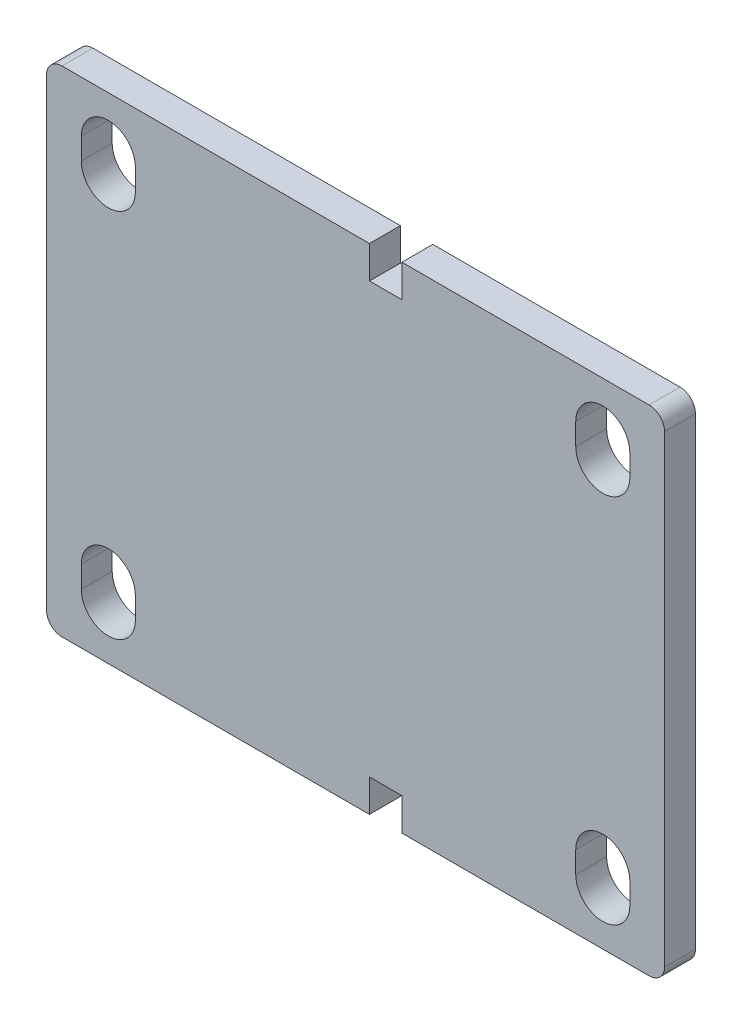
ISO-10303-21;
HEADER;
FILE_DESCRIPTION(('STEP AP214'),'2;1');
FILE_NAME('part.step','',(''),(''),'','','');
FILE_SCHEMA(('AUTOMOTIVE_DESIGN { 1 0 10303 214 1 1 1 1 }'));
ENDSEC;
DATA;
#1=APPLICATION_CONTEXT('core data for automotive mechanical design processes');
#2=APPLICATION_PROTOCOL_DEFINITION('international standard','automotive_design',2000,#1);
#3=PRODUCT_CONTEXT('',#1,'mechanical');
#4=PRODUCT('Part','Part','',(#3));
#5=PRODUCT_RELATED_PRODUCT_CATEGORY('part','',(#4));
#6=PRODUCT_DEFINITION_FORMATION('','',#4);
#7=PRODUCT_DEFINITION_CONTEXT('part definition',#1,'design');
#8=PRODUCT_DEFINITION('design','',#6,#7);
#9=PRODUCT_DEFINITION_SHAPE('','',#8);
#10=(LENGTH_UNIT() NAMED_UNIT(*) SI_UNIT(.MILLI.,.METRE.));
#11=(NAMED_UNIT(*) PLANE_ANGLE_UNIT() SI_UNIT($,.RADIAN.));
#12=(NAMED_UNIT(*) SI_UNIT($,.STERADIAN.) SOLID_ANGLE_UNIT());
#13=UNCERTAINTY_MEASURE_WITH_UNIT(LENGTH_MEASURE(1.E-05),#10,'distance_accuracy_value','');
#14=(GEOMETRIC_REPRESENTATION_CONTEXT(3) GLOBAL_UNCERTAINTY_ASSIGNED_CONTEXT((#13)) GLOBAL_UNIT_ASSIGNED_CONTEXT((#10,
#11,#12)) REPRESENTATION_CONTEXT('',''));
#15=CARTESIAN_POINT('',(0.,0.,0.));
#16=DIRECTION('',(0.,0.,1.));
#17=DIRECTION('',(1.,0.,0.));
#18=AXIS2_PLACEMENT_3D('',#15,#16,#17);
#19=CARTESIAN_POINT('',(0.,0.,10.));
#20=DIRECTION('',(0.,0.,1.));
#21=DIRECTION('',(1.,0.,0.));
#22=AXIS2_PLACEMENT_3D('',#19,#20,#21);
#23=PLANE('',#22);
#24=CARTESIAN_POINT('',(80.,-63.5,10.));
#25=DIRECTION('',(0.,0.,1.));
#26=DIRECTION('',(-1.,0.,0.));
#27=AXIS2_PLACEMENT_3D('',#24,#25,#26);
#28=CIRCLE('',#27,8.75000000000001);
#29=CARTESIAN_POINT('',(71.25,-63.5,10.));
#30=VERTEX_POINT('',#29);
#31=CARTESIAN_POINT('',(88.75,-63.5,10.));
#32=VERTEX_POINT('',#31);
#33=EDGE_CURVE('E299',#30,#32,#28,.T.);
#34=ORIENTED_EDGE('',*,*,#33,.F.);
#35=DIRECTION('',(0.,-1.,0.));
#36=VECTOR('',#35,1.);
#37=CARTESIAN_POINT('',(71.25,-63.5,10.));
#38=LINE('',#37,#36);
#39=CARTESIAN_POINT('',(71.25,-56.5,10.));
#40=VERTEX_POINT('',#39);
#41=EDGE_CURVE('E307',#40,#30,#38,.T.);
#42=ORIENTED_EDGE('',*,*,#41,.F.);
#43=CARTESIAN_POINT('',(80.,-56.5,10.));
#44=DIRECTION('',(0.,0.,1.));
#45=DIRECTION('',(-1.,0.,0.));
#46=AXIS2_PLACEMENT_3D('',#43,#44,#45);
#47=CIRCLE('',#46,8.75000000000001);
#48=CARTESIAN_POINT('',(88.75,-56.5,10.));
#49=VERTEX_POINT('',#48);
#50=EDGE_CURVE('E319',#49,#40,#47,.T.);
#51=ORIENTED_EDGE('',*,*,#50,.F.);
#52=DIRECTION('',(0.,1.,0.));
#53=VECTOR('',#52,1.);
#54=CARTESIAN_POINT('',(88.75,-63.5,10.));
#55=LINE('',#54,#53);
#56=EDGE_CURVE('E317',#32,#49,#55,.T.);
#57=ORIENTED_EDGE('',*,*,#56,.F.);
#58=EDGE_LOOP('',(#34,#42,#51,#57));
#59=FACE_BOUND('',#58,.T.);
#60=DIRECTION('',(0.,1.,0.));
#61=VECTOR('',#60,1.);
#62=CARTESIAN_POINT('',(-71.25,63.5,10.));
#63=LINE('',#62,#61);
#64=CARTESIAN_POINT('',(-71.25,56.5,10.));
#65=VERTEX_POINT('',#64);
#66=CARTESIAN_POINT('',(-71.25,63.5,10.));
#67=VERTEX_POINT('',#66);
#68=EDGE_CURVE('E369',#65,#67,#63,.T.);
#69=ORIENTED_EDGE('',*,*,#68,.F.);
#70=CARTESIAN_POINT('',(-80.,56.5,10.));
#71=DIRECTION('',(0.,0.,1.));
#72=DIRECTION('',(1.,0.,0.));
#73=AXIS2_PLACEMENT_3D('',#70,#71,#72);
#74=CIRCLE('',#73,8.75000000000001);
#75=CARTESIAN_POINT('',(-88.75,56.5,10.));
#76=VERTEX_POINT('',#75);
#77=EDGE_CURVE('E383',#76,#65,#74,.T.);
#78=ORIENTED_EDGE('',*,*,#77,.F.);
#79=DIRECTION('',(0.,-1.,0.));
#80=VECTOR('',#79,1.);
#81=CARTESIAN_POINT('',(-88.75,63.5,10.));
#82=LINE('',#81,#80);
#83=CARTESIAN_POINT('',(-88.75,63.5,10.));
#84=VERTEX_POINT('',#83);
#85=EDGE_CURVE('E381',#84,#76,#82,.T.);
#86=ORIENTED_EDGE('',*,*,#85,.F.);
#87=CARTESIAN_POINT('',(-80.,63.5,10.));
#88=DIRECTION('',(0.,0.,1.));
#89=DIRECTION('',(1.,0.,0.));
#90=AXIS2_PLACEMENT_3D('',#87,#88,#89);
#91=CIRCLE('',#90,8.75000000000001);
#92=EDGE_CURVE('E357',#67,#84,#91,.T.);
#93=ORIENTED_EDGE('',*,*,#92,.F.);
#94=EDGE_LOOP('',(#69,#78,#86,#93));
#95=FACE_BOUND('',#94,.T.);
#96=DIRECTION('',(0.,-1.,0.));
#97=VECTOR('',#96,1.);
#98=CARTESIAN_POINT('',(-100.,-80.,10.));
#99=LINE('',#98,#97);
#100=CARTESIAN_POINT('',(-100.,75.,10.));
#101=VERTEX_POINT('',#100);
#102=CARTESIAN_POINT('',(-100.,-75.,10.));
#103=VERTEX_POINT('',#102);
#104=EDGE_CURVE('E452',#101,#103,#99,.T.);
#105=ORIENTED_EDGE('',*,*,#104,.T.);
#106=CARTESIAN_POINT('',(-95.,-75.,10.));
#107=DIRECTION('',(0.,0.,1.));
#108=DIRECTION('',(1.,0.,0.));
#109=AXIS2_PLACEMENT_3D('',#106,#107,#108);
#110=CIRCLE('',#109,5.);
#111=CARTESIAN_POINT('',(-95.,-80.,10.));
#112=VERTEX_POINT('',#111);
#113=EDGE_CURVE('E497',#103,#112,#110,.T.);
#114=ORIENTED_EDGE('',*,*,#113,.T.);
#115=DIRECTION('',(1.,0.,0.));
#116=VECTOR('',#115,1.);
#117=CARTESIAN_POINT('',(100.,-80.,10.));
#118=LINE('',#117,#116);
#119=CARTESIAN_POINT('',(4.50000000000002,-80.,10.));
#120=VERTEX_POINT('',#119);
#121=EDGE_CURVE('E457',#112,#120,#118,.T.);
#122=ORIENTED_EDGE('',*,*,#121,.T.);
#123=DIRECTION('',(0.,-1.,0.));
#124=VECTOR('',#123,1.);
#125=CARTESIAN_POINT('',(4.50000000000001,-80.,10.));
#126=LINE('',#125,#124);
#127=CARTESIAN_POINT('',(4.50000000000001,-69.5,10.));
#128=VERTEX_POINT('',#127);
#129=EDGE_CURVE('E402',#128,#120,#126,.T.);
#130=ORIENTED_EDGE('',*,*,#129,.F.);
#131=DIRECTION('',(-1.,0.,0.));
#132=VECTOR('',#131,1.);
#133=CARTESIAN_POINT('',(15.,-69.5,10.));
#134=LINE('',#133,#132);
#135=CARTESIAN_POINT('',(15.,-69.5,10.));
#136=VERTEX_POINT('',#135);
#137=EDGE_CURVE('E411',#136,#128,#134,.T.);
#138=ORIENTED_EDGE('',*,*,#137,.F.);
#139=DIRECTION('',(0.,1.,0.));
#140=VECTOR('',#139,1.);
#141=CARTESIAN_POINT('',(15.,-80.,10.));
#142=LINE('',#141,#140);
#143=CARTESIAN_POINT('',(15.,-80.,10.));
#144=VERTEX_POINT('',#143);
#145=EDGE_CURVE('E390',#144,#136,#142,.T.);
#146=ORIENTED_EDGE('',*,*,#145,.F.);
#147=CARTESIAN_POINT('',(95.,-80.,10.));
#148=VERTEX_POINT('',#147);
#149=EDGE_CURVE('E455',#144,#148,#118,.T.);
#150=ORIENTED_EDGE('',*,*,#149,.T.);
#151=CARTESIAN_POINT('',(95.,-75.,10.));
#152=DIRECTION('',(0.,0.,1.));
#153=DIRECTION('',(1.,0.,0.));
#154=AXIS2_PLACEMENT_3D('',#151,#152,#153);
#155=CIRCLE('',#154,5.);
#156=CARTESIAN_POINT('',(100.,-75.,10.));
#157=VERTEX_POINT('',#156);
#158=EDGE_CURVE('E495',#148,#157,#155,.T.);
#159=ORIENTED_EDGE('',*,*,#158,.T.);
#160=DIRECTION('',(0.,1.,0.));
#161=VECTOR('',#160,1.);
#162=CARTESIAN_POINT('',(100.,-80.,10.));
#163=LINE('',#162,#161);
#164=CARTESIAN_POINT('',(100.,75.,10.));
#165=VERTEX_POINT('',#164);
#166=EDGE_CURVE('E459',#157,#165,#163,.T.);
#167=ORIENTED_EDGE('',*,*,#166,.T.);
#168=CARTESIAN_POINT('',(95.,75.,10.));
#169=DIRECTION('',(0.,0.,1.));
#170=DIRECTION('',(1.,0.,0.));
#171=AXIS2_PLACEMENT_3D('',#168,#169,#170);
#172=CIRCLE('',#171,5.);
#173=CARTESIAN_POINT('',(95.,80.,10.));
#174=VERTEX_POINT('',#173);
#175=EDGE_CURVE('E493',#165,#174,#172,.T.);
#176=ORIENTED_EDGE('',*,*,#175,.T.);
#177=DIRECTION('',(-1.,0.,0.));
#178=VECTOR('',#177,1.);
#179=CARTESIAN_POINT('',(100.,80.,10.));
#180=LINE('',#179,#178);
#181=CARTESIAN_POINT('',(15.,80.,10.));
#182=VERTEX_POINT('',#181);
#183=EDGE_CURVE('E463',#174,#182,#180,.T.);
#184=ORIENTED_EDGE('',*,*,#183,.T.);
#185=DIRECTION('',(0.,1.,0.));
#186=VECTOR('',#185,1.);
#187=CARTESIAN_POINT('',(15.,80.,10.));
#188=LINE('',#187,#186);
#189=CARTESIAN_POINT('',(15.,69.5,10.));
#190=VERTEX_POINT('',#189);
#191=EDGE_CURVE('E418',#190,#182,#188,.T.);
#192=ORIENTED_EDGE('',*,*,#191,.F.);
#193=DIRECTION('',(1.,0.,0.));
#194=VECTOR('',#193,1.);
#195=CARTESIAN_POINT('',(15.,69.5,10.));
#196=LINE('',#195,#194);
#197=CARTESIAN_POINT('',(4.50000000000001,69.5,10.));
#198=VERTEX_POINT('',#197);
#199=EDGE_CURVE('E429',#198,#190,#196,.T.);
#200=ORIENTED_EDGE('',*,*,#199,.F.);
#201=DIRECTION('',(0.,-1.,0.));
#202=VECTOR('',#201,1.);
#203=CARTESIAN_POINT('',(4.50000000000001,80.,10.));
#204=LINE('',#203,#202);
#205=CARTESIAN_POINT('',(4.50000000000001,80.,10.));
#206=VERTEX_POINT('',#205);
#207=EDGE_CURVE('E438',#206,#198,#204,.T.);
#208=ORIENTED_EDGE('',*,*,#207,.F.);
#209=CARTESIAN_POINT('',(-95.,80.,10.));
#210=VERTEX_POINT('',#209);
#211=EDGE_CURVE('E462',#206,#210,#180,.T.);
#212=ORIENTED_EDGE('',*,*,#211,.T.);
#213=CARTESIAN_POINT('',(-95.,75.,10.));
#214=DIRECTION('',(0.,0.,1.));
#215=DIRECTION('',(1.,0.,0.));
#216=AXIS2_PLACEMENT_3D('',#213,#214,#215);
#217=CIRCLE('',#216,5.);
#218=EDGE_CURVE('E491',#210,#101,#217,.T.);
#219=ORIENTED_EDGE('',*,*,#218,.T.);
#220=EDGE_LOOP('',(#105,#114,#122,#130,#138,#146,#150,#159,#167,#176,#184,#192,#200,#208,#212,#219));
#221=FACE_BOUND('',#220,.T.);
#222=DIRECTION('',(0.,-1.,0.));
#223=VECTOR('',#222,1.);
#224=CARTESIAN_POINT('',(-71.25,-63.5,10.));
#225=LINE('',#224,#223);
#226=CARTESIAN_POINT('',(-71.25,-56.5,10.));
#227=VERTEX_POINT('',#226);
#228=CARTESIAN_POINT('',(-71.25,-63.5,10.));
#229=VERTEX_POINT('',#228);
#230=EDGE_CURVE('E346',#227,#229,#225,.T.);
#231=ORIENTED_EDGE('',*,*,#230,.T.);
#232=CARTESIAN_POINT('',(-80.,-63.5,10.));
#233=DIRECTION('',(0.,0.,-1.));
#234=DIRECTION('',(1.,0.,0.));
#235=AXIS2_PLACEMENT_3D('',#232,#233,#234);
#236=CIRCLE('',#235,8.75000000000001);
#237=CARTESIAN_POINT('',(-88.75,-63.5,10.));
#238=VERTEX_POINT('',#237);
#239=EDGE_CURVE('E326',#229,#238,#236,.T.);
#240=ORIENTED_EDGE('',*,*,#239,.T.);
#241=DIRECTION('',(0.,1.,0.));
#242=VECTOR('',#241,1.);
#243=CARTESIAN_POINT('',(-88.75,-63.5,10.));
#244=LINE('',#243,#242);
#245=CARTESIAN_POINT('',(-88.75,-56.5,10.));
#246=VERTEX_POINT('',#245);
#247=EDGE_CURVE('E337',#238,#246,#244,.T.);
#248=ORIENTED_EDGE('',*,*,#247,.T.);
#249=CARTESIAN_POINT('',(-80.,-56.5,10.));
#250=DIRECTION('',(0.,0.,-1.));
#251=DIRECTION('',(1.,0.,0.));
#252=AXIS2_PLACEMENT_3D('',#249,#250,#251);
#253=CIRCLE('',#252,8.75000000000001);
#254=EDGE_CURVE('E349',#246,#227,#253,.T.);
#255=ORIENTED_EDGE('',*,*,#254,.T.);
#256=EDGE_LOOP('',(#231,#240,#248,#255));
#257=FACE_BOUND('',#256,.T.);
#258=DIRECTION('',(0.,1.,0.));
#259=VECTOR('',#258,1.);
#260=CARTESIAN_POINT('',(71.25,63.5,10.));
#261=LINE('',#260,#259);
#262=CARTESIAN_POINT('',(71.25,56.5,10.));
#263=VERTEX_POINT('',#262);
#264=CARTESIAN_POINT('',(71.25,63.5,10.));
#265=VERTEX_POINT('',#264);
#266=EDGE_CURVE('E293',#263,#265,#261,.T.);
#267=ORIENTED_EDGE('',*,*,#266,.T.);
#268=CARTESIAN_POINT('',(80.,63.5,10.));
#269=DIRECTION('',(0.,0.,-1.));
#270=DIRECTION('',(-1.,0.,0.));
#271=AXIS2_PLACEMENT_3D('',#268,#269,#270);
#272=CIRCLE('',#271,8.75000000000001);
#273=CARTESIAN_POINT('',(88.75,63.5,10.));
#274=VERTEX_POINT('',#273);
#275=EDGE_CURVE('E69',#265,#274,#272,.T.);
#276=ORIENTED_EDGE('',*,*,#275,.T.);
#277=DIRECTION('',(0.,-1.,0.));
#278=VECTOR('',#277,1.);
#279=CARTESIAN_POINT('',(88.75,63.5,10.));
#280=LINE('',#279,#278);
#281=CARTESIAN_POINT('',(88.75,56.5,10.));
#282=VERTEX_POINT('',#281);
#283=EDGE_CURVE('E284',#274,#282,#280,.T.);
#284=ORIENTED_EDGE('',*,*,#283,.T.);
#285=CARTESIAN_POINT('',(80.,56.5,10.));
#286=DIRECTION('',(0.,0.,-1.));
#287=DIRECTION('',(-1.,0.,0.));
#288=AXIS2_PLACEMENT_3D('',#285,#286,#287);
#289=CIRCLE('',#288,8.75000000000001);
#290=EDGE_CURVE('E287',#282,#263,#289,.T.);
#291=ORIENTED_EDGE('',*,*,#290,.T.);
#292=EDGE_LOOP('',(#267,#276,#284,#291));
#293=FACE_BOUND('',#292,.T.);
#294=ADVANCED_FACE('F54',(#59,#95,#221,#257,#293),#23,.T.);
#295=CARTESIAN_POINT('',(0.,0.,0.));
#296=DIRECTION('',(0.,0.,1.));
#297=DIRECTION('',(1.,0.,0.));
#298=AXIS2_PLACEMENT_3D('',#295,#296,#297);
#299=PLANE('',#298);
#300=DIRECTION('',(1.,0.,0.));
#301=VECTOR('',#300,1.);
#302=CARTESIAN_POINT('',(100.,-80.,0.));
#303=LINE('',#302,#301);
#304=CARTESIAN_POINT('',(-95.,-80.,0.));
#305=VERTEX_POINT('',#304);
#306=CARTESIAN_POINT('',(4.50000000000001,-80.,0.));
#307=VERTEX_POINT('',#306);
#308=EDGE_CURVE('E469',#305,#307,#303,.T.);
#309=ORIENTED_EDGE('',*,*,#308,.F.);
#310=CARTESIAN_POINT('',(-95.,-75.,0.));
#311=DIRECTION('',(0.,0.,1.));
#312=DIRECTION('',(1.,0.,0.));
#313=AXIS2_PLACEMENT_3D('',#310,#311,#312);
#314=CIRCLE('',#313,5.);
#315=CARTESIAN_POINT('',(-100.,-75.,0.));
#316=VERTEX_POINT('',#315);
#317=EDGE_CURVE('E484',#305,#316,#314,.F.);
#318=ORIENTED_EDGE('',*,*,#317,.T.);
#319=DIRECTION('',(0.,-1.,0.));
#320=VECTOR('',#319,1.);
#321=CARTESIAN_POINT('',(-100.,-80.,0.));
#322=LINE('',#321,#320);
#323=CARTESIAN_POINT('',(-100.,75.,0.));
#324=VERTEX_POINT('',#323);
#325=EDGE_CURVE('E445',#324,#316,#322,.T.);
#326=ORIENTED_EDGE('',*,*,#325,.F.);
#327=CARTESIAN_POINT('',(-95.,75.,0.));
#328=DIRECTION('',(0.,0.,1.));
#329=DIRECTION('',(1.,0.,0.));
#330=AXIS2_PLACEMENT_3D('',#327,#328,#329);
#331=CIRCLE('',#330,5.);
#332=CARTESIAN_POINT('',(-95.,80.,0.));
#333=VERTEX_POINT('',#332);
#334=EDGE_CURVE('E478',#324,#333,#331,.F.);
#335=ORIENTED_EDGE('',*,*,#334,.T.);
#336=DIRECTION('',(-1.,0.,0.));
#337=VECTOR('',#336,1.);
#338=CARTESIAN_POINT('',(100.,80.,0.));
#339=LINE('',#338,#337);
#340=CARTESIAN_POINT('',(4.50000000000002,80.,0.));
#341=VERTEX_POINT('',#340);
#342=EDGE_CURVE('E474',#341,#333,#339,.T.);
#343=ORIENTED_EDGE('',*,*,#342,.F.);
#344=DIRECTION('',(0.,-1.,0.));
#345=VECTOR('',#344,1.);
#346=CARTESIAN_POINT('',(4.50000000000001,80.,0.));
#347=LINE('',#346,#345);
#348=CARTESIAN_POINT('',(4.50000000000001,69.5,0.));
#349=VERTEX_POINT('',#348);
#350=EDGE_CURVE('E428',#341,#349,#347,.T.);
#351=ORIENTED_EDGE('',*,*,#350,.T.);
#352=DIRECTION('',(1.,0.,0.));
#353=VECTOR('',#352,1.);
#354=CARTESIAN_POINT('',(15.,69.5,0.));
#355=LINE('',#354,#353);
#356=CARTESIAN_POINT('',(15.,69.5,0.));
#357=VERTEX_POINT('',#356);
#358=EDGE_CURVE('E432',#349,#357,#355,.T.);
#359=ORIENTED_EDGE('',*,*,#358,.T.);
#360=DIRECTION('',(0.,1.,0.));
#361=VECTOR('',#360,1.);
#362=CARTESIAN_POINT('',(15.,80.,0.));
#363=LINE('',#362,#361);
#364=CARTESIAN_POINT('',(15.,80.,0.));
#365=VERTEX_POINT('',#364);
#366=EDGE_CURVE('E425',#357,#365,#363,.T.);
#367=ORIENTED_EDGE('',*,*,#366,.T.);
#368=CARTESIAN_POINT('',(95.,80.,0.));
#369=VERTEX_POINT('',#368);
#370=EDGE_CURVE('E456',#369,#365,#339,.T.);
#371=ORIENTED_EDGE('',*,*,#370,.F.);
#372=CARTESIAN_POINT('',(95.,75.,0.));
#373=DIRECTION('',(0.,0.,1.));
#374=DIRECTION('',(1.,0.,0.));
#375=AXIS2_PLACEMENT_3D('',#372,#373,#374);
#376=CIRCLE('',#375,5.);
#377=CARTESIAN_POINT('',(100.,75.,0.));
#378=VERTEX_POINT('',#377);
#379=EDGE_CURVE('E480',#369,#378,#376,.F.);
#380=ORIENTED_EDGE('',*,*,#379,.T.);
#381=DIRECTION('',(0.,1.,0.));
#382=VECTOR('',#381,1.);
#383=CARTESIAN_POINT('',(100.,-80.,0.));
#384=LINE('',#383,#382);
#385=CARTESIAN_POINT('',(100.,-75.,0.));
#386=VERTEX_POINT('',#385);
#387=EDGE_CURVE('E471',#386,#378,#384,.T.);
#388=ORIENTED_EDGE('',*,*,#387,.F.);
#389=CARTESIAN_POINT('',(95.,-75.,0.));
#390=DIRECTION('',(0.,0.,1.));
#391=DIRECTION('',(1.,0.,0.));
#392=AXIS2_PLACEMENT_3D('',#389,#390,#391);
#393=CIRCLE('',#392,5.);
#394=CARTESIAN_POINT('',(95.,-80.,0.));
#395=VERTEX_POINT('',#394);
#396=EDGE_CURVE('E482',#386,#395,#393,.F.);
#397=ORIENTED_EDGE('',*,*,#396,.T.);
#398=CARTESIAN_POINT('',(15.,-80.,0.));
#399=VERTEX_POINT('',#398);
#400=EDGE_CURVE('E468',#399,#395,#303,.T.);
#401=ORIENTED_EDGE('',*,*,#400,.F.);
#402=DIRECTION('',(0.,1.,0.));
#403=VECTOR('',#402,1.);
#404=CARTESIAN_POINT('',(15.,-80.,0.));
#405=LINE('',#404,#403);
#406=CARTESIAN_POINT('',(15.,-69.5,0.));
#407=VERTEX_POINT('',#406);
#408=EDGE_CURVE('E398',#399,#407,#405,.T.);
#409=ORIENTED_EDGE('',*,*,#408,.T.);
#410=DIRECTION('',(-1.,0.,0.));
#411=VECTOR('',#410,1.);
#412=CARTESIAN_POINT('',(15.,-69.5,0.));
#413=LINE('',#412,#411);
#414=CARTESIAN_POINT('',(4.50000000000001,-69.5,0.));
#415=VERTEX_POINT('',#414);
#416=EDGE_CURVE('E401',#407,#415,#413,.T.);
#417=ORIENTED_EDGE('',*,*,#416,.T.);
#418=DIRECTION('',(0.,-1.,0.));
#419=VECTOR('',#418,1.);
#420=CARTESIAN_POINT('',(4.50000000000001,-80.,0.));
#421=LINE('',#420,#419);
#422=EDGE_CURVE('E405',#415,#307,#421,.T.);
#423=ORIENTED_EDGE('',*,*,#422,.T.);
#424=EDGE_LOOP('',(#309,#318,#326,#335,#343,#351,#359,#367,#371,#380,#388,#397,#401,#409,#417,#423));
#425=FACE_BOUND('',#424,.T.);
#426=CARTESIAN_POINT('',(-80.,56.5,0.));
#427=DIRECTION('',(0.,0.,1.));
#428=DIRECTION('',(1.,0.,0.));
#429=AXIS2_PLACEMENT_3D('',#426,#427,#428);
#430=CIRCLE('',#429,8.75000000000001);
#431=CARTESIAN_POINT('',(-88.75,56.5,0.));
#432=VERTEX_POINT('',#431);
#433=CARTESIAN_POINT('',(-71.25,56.5,0.));
#434=VERTEX_POINT('',#433);
#435=EDGE_CURVE('E372',#432,#434,#430,.T.);
#436=ORIENTED_EDGE('',*,*,#435,.T.);
#437=DIRECTION('',(0.,1.,0.));
#438=VECTOR('',#437,1.);
#439=CARTESIAN_POINT('',(-71.25,63.5,0.));
#440=LINE('',#439,#438);
#441=CARTESIAN_POINT('',(-71.25,63.5,0.));
#442=VERTEX_POINT('',#441);
#443=EDGE_CURVE('E375',#434,#442,#440,.T.);
#444=ORIENTED_EDGE('',*,*,#443,.T.);
#445=CARTESIAN_POINT('',(-80.,63.5,0.));
#446=DIRECTION('',(0.,0.,1.));
#447=DIRECTION('',(1.,0.,0.));
#448=AXIS2_PLACEMENT_3D('',#445,#446,#447);
#449=CIRCLE('',#448,8.75000000000001);
#450=CARTESIAN_POINT('',(-88.75,63.5,0.));
#451=VERTEX_POINT('',#450);
#452=EDGE_CURVE('E365',#442,#451,#449,.T.);
#453=ORIENTED_EDGE('',*,*,#452,.T.);
#454=DIRECTION('',(0.,-1.,0.));
#455=VECTOR('',#454,1.);
#456=CARTESIAN_POINT('',(-88.75,63.5,0.));
#457=LINE('',#456,#455);
#458=EDGE_CURVE('E368',#451,#432,#457,.T.);
#459=ORIENTED_EDGE('',*,*,#458,.T.);
#460=EDGE_LOOP('',(#436,#444,#453,#459));
#461=FACE_BOUND('',#460,.T.);
#462=CARTESIAN_POINT('',(80.,-56.5,0.));
#463=DIRECTION('',(0.,0.,1.));
#464=DIRECTION('',(-1.,0.,0.));
#465=AXIS2_PLACEMENT_3D('',#462,#463,#464);
#466=CIRCLE('',#465,8.75000000000001);
#467=CARTESIAN_POINT('',(88.75,-56.5,0.));
#468=VERTEX_POINT('',#467);
#469=CARTESIAN_POINT('',(71.25,-56.5,0.));
#470=VERTEX_POINT('',#469);
#471=EDGE_CURVE('E77',#468,#470,#466,.T.);
#472=ORIENTED_EDGE('',*,*,#471,.T.);
#473=DIRECTION('',(0.,-1.,0.));
#474=VECTOR('',#473,1.);
#475=CARTESIAN_POINT('',(71.25,-63.5,0.));
#476=LINE('',#475,#474);
#477=CARTESIAN_POINT('',(71.25,-63.5,0.));
#478=VERTEX_POINT('',#477);
#479=EDGE_CURVE('E311',#470,#478,#476,.T.);
#480=ORIENTED_EDGE('',*,*,#479,.T.);
#481=CARTESIAN_POINT('',(80.,-63.5,0.));
#482=DIRECTION('',(0.,0.,1.));
#483=DIRECTION('',(-1.,0.,0.));
#484=AXIS2_PLACEMENT_3D('',#481,#482,#483);
#485=CIRCLE('',#484,8.75000000000001);
#486=CARTESIAN_POINT('',(88.75,-63.5,0.));
#487=VERTEX_POINT('',#486);
#488=EDGE_CURVE('E303',#478,#487,#485,.T.);
#489=ORIENTED_EDGE('',*,*,#488,.T.);
#490=DIRECTION('',(0.,1.,0.));
#491=VECTOR('',#490,1.);
#492=CARTESIAN_POINT('',(88.75,-63.5,0.));
#493=LINE('',#492,#491);
#494=EDGE_CURVE('E306',#487,#468,#493,.T.);
#495=ORIENTED_EDGE('',*,*,#494,.T.);
#496=EDGE_LOOP('',(#472,#480,#489,#495));
#497=FACE_BOUND('',#496,.T.);
#498=CARTESIAN_POINT('',(-80.,-63.5,0.));
#499=DIRECTION('',(0.,0.,-1.));
#500=DIRECTION('',(1.,0.,0.));
#501=AXIS2_PLACEMENT_3D('',#498,#499,#500);
#502=CIRCLE('',#501,8.75000000000001);
#503=CARTESIAN_POINT('',(-71.25,-63.5,0.));
#504=VERTEX_POINT('',#503);
#505=CARTESIAN_POINT('',(-88.75,-63.5,0.));
#506=VERTEX_POINT('',#505);
#507=EDGE_CURVE('E333',#504,#506,#502,.T.);
#508=ORIENTED_EDGE('',*,*,#507,.F.);
#509=DIRECTION('',(0.,-1.,0.));
#510=VECTOR('',#509,1.);
#511=CARTESIAN_POINT('',(-71.25,-63.5,0.));
#512=LINE('',#511,#510);
#513=CARTESIAN_POINT('',(-71.25,-56.5,0.));
#514=VERTEX_POINT('',#513);
#515=EDGE_CURVE('E336',#514,#504,#512,.T.);
#516=ORIENTED_EDGE('',*,*,#515,.F.);
#517=CARTESIAN_POINT('',(-80.,-56.5,0.));
#518=DIRECTION('',(0.,0.,-1.));
#519=DIRECTION('',(1.,0.,0.));
#520=AXIS2_PLACEMENT_3D('',#517,#518,#519);
#521=CIRCLE('',#520,8.75000000000001);
#522=CARTESIAN_POINT('',(-88.75,-56.5,0.));
#523=VERTEX_POINT('',#522);
#524=EDGE_CURVE('E339',#523,#514,#521,.T.);
#525=ORIENTED_EDGE('',*,*,#524,.F.);
#526=DIRECTION('',(0.,1.,0.));
#527=VECTOR('',#526,1.);
#528=CARTESIAN_POINT('',(-88.75,-63.5,0.));
#529=LINE('',#528,#527);
#530=EDGE_CURVE('E341',#506,#523,#529,.T.);
#531=ORIENTED_EDGE('',*,*,#530,.F.);
#532=EDGE_LOOP('',(#508,#516,#525,#531));
#533=FACE_BOUND('',#532,.T.);
#534=CARTESIAN_POINT('',(80.,63.5,0.));
#535=DIRECTION('',(0.,0.,-1.));
#536=DIRECTION('',(-1.,0.,0.));
#537=AXIS2_PLACEMENT_3D('',#534,#535,#536);
#538=CIRCLE('',#537,8.75000000000001);
#539=CARTESIAN_POINT('',(71.25,63.5,0.));
#540=VERTEX_POINT('',#539);
#541=CARTESIAN_POINT('',(88.75,63.5,0.));
#542=VERTEX_POINT('',#541);
#543=EDGE_CURVE('E276',#540,#542,#538,.T.);
#544=ORIENTED_EDGE('',*,*,#543,.F.);
#545=DIRECTION('',(0.,1.,0.));
#546=VECTOR('',#545,1.);
#547=CARTESIAN_POINT('',(71.25,63.5,0.));
#548=LINE('',#547,#546);
#549=CARTESIAN_POINT('',(71.25,56.5,0.));
#550=VERTEX_POINT('',#549);
#551=EDGE_CURVE('E265',#550,#540,#548,.T.);
#552=ORIENTED_EDGE('',*,*,#551,.F.);
#553=CARTESIAN_POINT('',(80.,56.5,0.));
#554=DIRECTION('',(0.,0.,-1.));
#555=DIRECTION('',(-1.,0.,0.));
#556=AXIS2_PLACEMENT_3D('',#553,#554,#555);
#557=CIRCLE('',#556,8.75000000000001);
#558=CARTESIAN_POINT('',(88.75,56.5,0.));
#559=VERTEX_POINT('',#558);
#560=EDGE_CURVE('E275',#559,#550,#557,.T.);
#561=ORIENTED_EDGE('',*,*,#560,.F.);
#562=DIRECTION('',(0.,-1.,0.));
#563=VECTOR('',#562,1.);
#564=CARTESIAN_POINT('',(88.75,63.5,0.));
#565=LINE('',#564,#563);
#566=EDGE_CURVE('E280',#542,#559,#565,.T.);
#567=ORIENTED_EDGE('',*,*,#566,.F.);
#568=EDGE_LOOP('',(#544,#552,#561,#567));
#569=FACE_BOUND('',#568,.T.);
#570=ADVANCED_FACE('F283',(#425,#461,#497,#533,#569),#299,.F.);
#571=CARTESIAN_POINT('',(100.,-80.,10.));
#572=DIRECTION('',(0.,1.,0.));
#573=DIRECTION('',(-1.,0.,0.));
#574=AXIS2_PLACEMENT_3D('',#571,#572,#573);
#575=PLANE('',#574);
#576=ORIENTED_EDGE('',*,*,#400,.T.);
#577=DIRECTION('',(0.,0.,-1.));
#578=VECTOR('',#577,1.);
#579=CARTESIAN_POINT('',(95.,-80.,10.));
#580=LINE('',#579,#578);
#581=EDGE_CURVE('E504',#395,#148,#580,.F.);
#582=ORIENTED_EDGE('',*,*,#581,.T.);
#583=ORIENTED_EDGE('',*,*,#149,.F.);
#584=DIRECTION('',(0.,0.,1.));
#585=VECTOR('',#584,1.);
#586=CARTESIAN_POINT('',(15.,-80.,0.));
#587=LINE('',#586,#585);
#588=EDGE_CURVE('E416',#399,#144,#587,.T.);
#589=ORIENTED_EDGE('',*,*,#588,.F.);
#590=EDGE_LOOP('',(#576,#582,#583,#589));
#591=FACE_BOUND('',#590,.T.);
#592=ADVANCED_FACE('F539',(#591),#575,.F.);
#593=CARTESIAN_POINT('',(100.,80.,10.));
#594=DIRECTION('',(0.,-1.,0.));
#595=DIRECTION('',(1.,0.,0.));
#596=AXIS2_PLACEMENT_3D('',#593,#594,#595);
#597=PLANE('',#596);
#598=ORIENTED_EDGE('',*,*,#183,.F.);
#599=DIRECTION('',(0.,0.,-1.));
#600=VECTOR('',#599,1.);
#601=CARTESIAN_POINT('',(95.,80.,10.));
#602=LINE('',#601,#600);
#603=EDGE_CURVE('E62',#174,#369,#602,.T.);
#604=ORIENTED_EDGE('',*,*,#603,.T.);
#605=ORIENTED_EDGE('',*,*,#370,.T.);
#606=DIRECTION('',(0.,0.,1.));
#607=VECTOR('',#606,1.);
#608=CARTESIAN_POINT('',(15.,80.,0.));
#609=LINE('',#608,#607);
#610=EDGE_CURVE('E435',#365,#182,#609,.T.);
#611=ORIENTED_EDGE('',*,*,#610,.T.);
#612=EDGE_LOOP('',(#598,#604,#605,#611));
#613=FACE_BOUND('',#612,.T.);
#614=ADVANCED_FACE('F510',(#613),#597,.F.);
#615=CARTESIAN_POINT('',(-100.,-80.,10.));
#616=DIRECTION('',(1.,0.,0.));
#617=DIRECTION('',(0.,0.,-1.));
#618=AXIS2_PLACEMENT_3D('',#615,#616,#617);
#619=PLANE('',#618);
#620=ORIENTED_EDGE('',*,*,#325,.T.);
#621=DIRECTION('',(0.,0.,-1.));
#622=VECTOR('',#621,1.);
#623=CARTESIAN_POINT('',(-100.,-75.,10.));
#624=LINE('',#623,#622);
#625=EDGE_CURVE('E489',#316,#103,#624,.F.);
#626=ORIENTED_EDGE('',*,*,#625,.T.);
#627=ORIENTED_EDGE('',*,*,#104,.F.);
#628=DIRECTION('',(0.,0.,-1.));
#629=VECTOR('',#628,1.);
#630=CARTESIAN_POINT('',(-100.,75.,10.));
#631=LINE('',#630,#629);
#632=EDGE_CURVE('E486',#101,#324,#631,.T.);
#633=ORIENTED_EDGE('',*,*,#632,.T.);
#634=EDGE_LOOP('',(#620,#626,#627,#633));
#635=FACE_BOUND('',#634,.T.);
#636=ADVANCED_FACE('F564',(#635),#619,.F.);
#637=ORIENTED_EDGE('',*,*,#121,.F.);
#638=DIRECTION('',(0.,0.,-1.));
#639=VECTOR('',#638,1.);
#640=CARTESIAN_POINT('',(-95.,-80.,10.));
#641=LINE('',#640,#639);
#642=EDGE_CURVE('E465',#112,#305,#641,.T.);
#643=ORIENTED_EDGE('',*,*,#642,.T.);
#644=ORIENTED_EDGE('',*,*,#308,.T.);
#645=DIRECTION('',(0.,0.,1.));
#646=VECTOR('',#645,1.);
#647=CARTESIAN_POINT('',(4.50000000000001,-80.,0.));
#648=LINE('',#647,#646);
#649=EDGE_CURVE('E419',#307,#120,#648,.T.);
#650=ORIENTED_EDGE('',*,*,#649,.T.);
#651=EDGE_LOOP('',(#637,#643,#644,#650));
#652=FACE_BOUND('',#651,.T.);
#653=ADVANCED_FACE('F558',(#652),#575,.F.);
#654=CARTESIAN_POINT('',(100.,-80.,10.));
#655=DIRECTION('',(-1.,0.,0.));
#656=DIRECTION('',(0.,0.,1.));
#657=AXIS2_PLACEMENT_3D('',#654,#655,#656);
#658=PLANE('',#657);
#659=ORIENTED_EDGE('',*,*,#166,.F.);
#660=DIRECTION('',(0.,0.,-1.));
#661=VECTOR('',#660,1.);
#662=CARTESIAN_POINT('',(100.,-75.,10.));
#663=LINE('',#662,#661);
#664=EDGE_CURVE('E501',#157,#386,#663,.T.);
#665=ORIENTED_EDGE('',*,*,#664,.T.);
#666=ORIENTED_EDGE('',*,*,#387,.T.);
#667=DIRECTION('',(0.,0.,-1.));
#668=VECTOR('',#667,1.);
#669=CARTESIAN_POINT('',(100.,75.,10.));
#670=LINE('',#669,#668);
#671=EDGE_CURVE('E499',#378,#165,#670,.F.);
#672=ORIENTED_EDGE('',*,*,#671,.T.);
#673=EDGE_LOOP('',(#659,#665,#666,#672));
#674=FACE_BOUND('',#673,.T.);
#675=ADVANCED_FACE('F531',(#674),#658,.F.);
#676=ORIENTED_EDGE('',*,*,#342,.T.);
#677=DIRECTION('',(0.,0.,-1.));
#678=VECTOR('',#677,1.);
#679=CARTESIAN_POINT('',(-95.,80.,10.));
#680=LINE('',#679,#678);
#681=EDGE_CURVE('E12',#333,#210,#680,.F.);
#682=ORIENTED_EDGE('',*,*,#681,.T.);
#683=ORIENTED_EDGE('',*,*,#211,.F.);
#684=DIRECTION('',(0.,0.,1.));
#685=VECTOR('',#684,1.);
#686=CARTESIAN_POINT('',(4.50000000000001,80.,0.));
#687=LINE('',#686,#685);
#688=EDGE_CURVE('E448',#341,#206,#687,.T.);
#689=ORIENTED_EDGE('',*,*,#688,.F.);
#690=EDGE_LOOP('',(#676,#682,#683,#689));
#691=FACE_BOUND('',#690,.T.);
#692=ADVANCED_FACE('F577',(#691),#597,.F.);
#693=CARTESIAN_POINT('',(15.,80.,0.));
#694=DIRECTION('',(1.,0.,0.));
#695=DIRECTION('',(0.,1.,0.));
#696=AXIS2_PLACEMENT_3D('',#693,#694,#695);
#697=PLANE('',#696);
#698=ORIENTED_EDGE('',*,*,#191,.T.);
#699=ORIENTED_EDGE('',*,*,#610,.F.);
#700=ORIENTED_EDGE('',*,*,#366,.F.);
#701=DIRECTION('',(0.,0.,1.));
#702=VECTOR('',#701,1.);
#703=CARTESIAN_POINT('',(15.,69.5,0.));
#704=LINE('',#703,#702);
#705=EDGE_CURVE('E443',#357,#190,#704,.T.);
#706=ORIENTED_EDGE('',*,*,#705,.T.);
#707=EDGE_LOOP('',(#698,#699,#700,#706));
#708=FACE_BOUND('',#707,.T.);
#709=ADVANCED_FACE('F521',(#708),#697,.F.);
#710=CARTESIAN_POINT('',(15.,69.5,0.));
#711=DIRECTION('',(0.,-1.,0.));
#712=DIRECTION('',(0.,0.,-1.));
#713=AXIS2_PLACEMENT_3D('',#710,#711,#712);
#714=PLANE('',#713);
#715=ORIENTED_EDGE('',*,*,#199,.T.);
#716=ORIENTED_EDGE('',*,*,#705,.F.);
#717=ORIENTED_EDGE('',*,*,#358,.F.);
#718=DIRECTION('',(0.,0.,1.));
#719=VECTOR('',#718,1.);
#720=CARTESIAN_POINT('',(4.50000000000001,69.5,0.));
#721=LINE('',#720,#719);
#722=EDGE_CURVE('E446',#349,#198,#721,.T.);
#723=ORIENTED_EDGE('',*,*,#722,.T.);
#724=EDGE_LOOP('',(#715,#716,#717,#723));
#725=FACE_BOUND('',#724,.T.);
#726=ADVANCED_FACE('F582',(#725),#714,.F.);
#727=CARTESIAN_POINT('',(4.50000000000001,80.,0.));
#728=DIRECTION('',(-1.,0.,0.));
#729=DIRECTION('',(0.,-1.,0.));
#730=AXIS2_PLACEMENT_3D('',#727,#728,#729);
#731=PLANE('',#730);
#732=ORIENTED_EDGE('',*,*,#207,.T.);
#733=ORIENTED_EDGE('',*,*,#722,.F.);
#734=ORIENTED_EDGE('',*,*,#350,.F.);
#735=ORIENTED_EDGE('',*,*,#688,.T.);
#736=EDGE_LOOP('',(#732,#733,#734,#735));
#737=FACE_BOUND('',#736,.T.);
#738=ADVANCED_FACE('F580',(#737),#731,.F.);
#739=CARTESIAN_POINT('',(15.,-80.,0.));
#740=DIRECTION('',(1.,0.,0.));
#741=DIRECTION('',(0.,0.,-1.));
#742=AXIS2_PLACEMENT_3D('',#739,#740,#741);
#743=PLANE('',#742);
#744=ORIENTED_EDGE('',*,*,#145,.T.);
#745=DIRECTION('',(0.,0.,1.));
#746=VECTOR('',#745,1.);
#747=CARTESIAN_POINT('',(15.,-69.5,0.));
#748=LINE('',#747,#746);
#749=EDGE_CURVE('E408',#407,#136,#748,.T.);
#750=ORIENTED_EDGE('',*,*,#749,.F.);
#751=ORIENTED_EDGE('',*,*,#408,.F.);
#752=ORIENTED_EDGE('',*,*,#588,.T.);
#753=EDGE_LOOP('',(#744,#750,#751,#752));
#754=FACE_BOUND('',#753,.T.);
#755=ADVANCED_FACE('F548',(#754),#743,.F.);
#756=CARTESIAN_POINT('',(4.50000000000001,-80.,0.));
#757=DIRECTION('',(-1.,0.,0.));
#758=DIRECTION('',(0.,0.,1.));
#759=AXIS2_PLACEMENT_3D('',#756,#757,#758);
#760=PLANE('',#759);
#761=ORIENTED_EDGE('',*,*,#129,.T.);
#762=ORIENTED_EDGE('',*,*,#649,.F.);
#763=ORIENTED_EDGE('',*,*,#422,.F.);
#764=DIRECTION('',(0.,0.,1.));
#765=VECTOR('',#764,1.);
#766=CARTESIAN_POINT('',(4.50000000000001,-69.5,0.));
#767=LINE('',#766,#765);
#768=EDGE_CURVE('E422',#415,#128,#767,.T.);
#769=ORIENTED_EDGE('',*,*,#768,.T.);
#770=EDGE_LOOP('',(#761,#762,#763,#769));
#771=FACE_BOUND('',#770,.T.);
#772=ADVANCED_FACE('F555',(#771),#760,.F.);
#773=CARTESIAN_POINT('',(15.,-69.5,0.));
#774=DIRECTION('',(0.,1.,0.));
#775=DIRECTION('',(0.,0.,1.));
#776=AXIS2_PLACEMENT_3D('',#773,#774,#775);
#777=PLANE('',#776);
#778=ORIENTED_EDGE('',*,*,#137,.T.);
#779=ORIENTED_EDGE('',*,*,#768,.F.);
#780=ORIENTED_EDGE('',*,*,#416,.F.);
#781=ORIENTED_EDGE('',*,*,#749,.T.);
#782=EDGE_LOOP('',(#778,#779,#780,#781));
#783=FACE_BOUND('',#782,.T.);
#784=ADVANCED_FACE('F552',(#783),#777,.F.);
#785=CARTESIAN_POINT('',(-95.,-75.,10.));
#786=DIRECTION('',(0.,0.,-1.));
#787=DIRECTION('',(-1.,0.,0.));
#788=AXIS2_PLACEMENT_3D('',#785,#786,#787);
#789=CYLINDRICAL_SURFACE('',#788,5.);
#790=ORIENTED_EDGE('',*,*,#113,.F.);
#791=ORIENTED_EDGE('',*,*,#625,.F.);
#792=ORIENTED_EDGE('',*,*,#317,.F.);
#793=ORIENTED_EDGE('',*,*,#642,.F.);
#794=EDGE_LOOP('',(#790,#791,#792,#793));
#795=FACE_BOUND('',#794,.T.);
#796=ADVANCED_FACE('F568',(#795),#789,.T.);
#797=CARTESIAN_POINT('',(95.,-75.,10.));
#798=DIRECTION('',(0.,0.,-1.));
#799=DIRECTION('',(-1.,0.,0.));
#800=AXIS2_PLACEMENT_3D('',#797,#798,#799);
#801=CYLINDRICAL_SURFACE('',#800,5.);
#802=ORIENTED_EDGE('',*,*,#158,.F.);
#803=ORIENTED_EDGE('',*,*,#581,.F.);
#804=ORIENTED_EDGE('',*,*,#396,.F.);
#805=ORIENTED_EDGE('',*,*,#664,.F.);
#806=EDGE_LOOP('',(#802,#803,#804,#805));
#807=FACE_BOUND('',#806,.T.);
#808=ADVANCED_FACE('F543',(#807),#801,.T.);
#809=CARTESIAN_POINT('',(95.,75.,10.));
#810=DIRECTION('',(0.,0.,-1.));
#811=DIRECTION('',(-1.,0.,0.));
#812=AXIS2_PLACEMENT_3D('',#809,#810,#811);
#813=CYLINDRICAL_SURFACE('',#812,5.);
#814=ORIENTED_EDGE('',*,*,#175,.F.);
#815=ORIENTED_EDGE('',*,*,#671,.F.);
#816=ORIENTED_EDGE('',*,*,#379,.F.);
#817=ORIENTED_EDGE('',*,*,#603,.F.);
#818=EDGE_LOOP('',(#814,#815,#816,#817));
#819=FACE_BOUND('',#818,.T.);
#820=ADVANCED_FACE('F529',(#819),#813,.T.);
#821=CARTESIAN_POINT('',(-95.,75.,10.));
#822=DIRECTION('',(0.,0.,-1.));
#823=DIRECTION('',(-1.,0.,0.));
#824=AXIS2_PLACEMENT_3D('',#821,#822,#823);
#825=CYLINDRICAL_SURFACE('',#824,5.);
#826=ORIENTED_EDGE('',*,*,#218,.F.);
#827=ORIENTED_EDGE('',*,*,#681,.F.);
#828=ORIENTED_EDGE('',*,*,#334,.F.);
#829=ORIENTED_EDGE('',*,*,#632,.F.);
#830=EDGE_LOOP('',(#826,#827,#828,#829));
#831=FACE_BOUND('',#830,.T.);
#832=ADVANCED_FACE('F56',(#831),#825,.T.);
#833=CARTESIAN_POINT('',(-71.25,63.5,0.));
#834=DIRECTION('',(1.,0.,0.));
#835=DIRECTION('',(0.,0.,-1.));
#836=AXIS2_PLACEMENT_3D('',#833,#834,#835);
#837=PLANE('',#836);
#838=ORIENTED_EDGE('',*,*,#68,.T.);
#839=DIRECTION('',(0.,0.,1.));
#840=VECTOR('',#839,1.);
#841=CARTESIAN_POINT('',(-71.25,63.5,0.));
#842=LINE('',#841,#840);
#843=EDGE_CURVE('E387',#442,#67,#842,.T.);
#844=ORIENTED_EDGE('',*,*,#843,.F.);
#845=ORIENTED_EDGE('',*,*,#443,.F.);
#846=DIRECTION('',(0.,0.,1.));
#847=VECTOR('',#846,1.);
#848=CARTESIAN_POINT('',(-71.25,56.5,0.));
#849=LINE('',#848,#847);
#850=EDGE_CURVE('E391',#434,#65,#849,.T.);
#851=ORIENTED_EDGE('',*,*,#850,.T.);
#852=EDGE_LOOP('',(#838,#844,#845,#851));
#853=FACE_BOUND('',#852,.T.);
#854=ADVANCED_FACE('F617',(#853),#837,.F.);
#855=CARTESIAN_POINT('',(-88.75,63.5,0.));
#856=DIRECTION('',(-1.,0.,0.));
#857=DIRECTION('',(0.,0.,1.));
#858=AXIS2_PLACEMENT_3D('',#855,#856,#857);
#859=PLANE('',#858);
#860=ORIENTED_EDGE('',*,*,#85,.T.);
#861=DIRECTION('',(0.,0.,1.));
#862=VECTOR('',#861,1.);
#863=CARTESIAN_POINT('',(-88.75,56.5,0.));
#864=LINE('',#863,#862);
#865=EDGE_CURVE('E394',#432,#76,#864,.T.);
#866=ORIENTED_EDGE('',*,*,#865,.F.);
#867=ORIENTED_EDGE('',*,*,#458,.F.);
#868=DIRECTION('',(0.,0.,1.));
#869=VECTOR('',#868,1.);
#870=CARTESIAN_POINT('',(-88.75,63.5,0.));
#871=LINE('',#870,#869);
#872=EDGE_CURVE('E378',#451,#84,#871,.T.);
#873=ORIENTED_EDGE('',*,*,#872,.T.);
#874=EDGE_LOOP('',(#860,#866,#867,#873));
#875=FACE_BOUND('',#874,.T.);
#876=ADVANCED_FACE('F621',(#875),#859,.F.);
#877=CARTESIAN_POINT('',(-80.,63.5,0.));
#878=DIRECTION('',(0.,0.,1.));
#879=DIRECTION('',(1.,0.,0.));
#880=AXIS2_PLACEMENT_3D('',#877,#878,#879);
#881=CYLINDRICAL_SURFACE('',#880,8.75000000000001);
#882=ORIENTED_EDGE('',*,*,#92,.T.);
#883=ORIENTED_EDGE('',*,*,#872,.F.);
#884=ORIENTED_EDGE('',*,*,#452,.F.);
#885=ORIENTED_EDGE('',*,*,#843,.T.);
#886=EDGE_LOOP('',(#882,#883,#884,#885));
#887=FACE_BOUND('',#886,.T.);
#888=ADVANCED_FACE('F627',(#887),#881,.F.);
#889=CARTESIAN_POINT('',(-80.,56.5,0.));
#890=DIRECTION('',(0.,0.,1.));
#891=DIRECTION('',(1.,0.,0.));
#892=AXIS2_PLACEMENT_3D('',#889,#890,#891);
#893=CYLINDRICAL_SURFACE('',#892,8.75000000000001);
#894=ORIENTED_EDGE('',*,*,#77,.T.);
#895=ORIENTED_EDGE('',*,*,#850,.F.);
#896=ORIENTED_EDGE('',*,*,#435,.F.);
#897=ORIENTED_EDGE('',*,*,#865,.T.);
#898=EDGE_LOOP('',(#894,#895,#896,#897));
#899=FACE_BOUND('',#898,.T.);
#900=ADVANCED_FACE('F634',(#899),#893,.F.);
#901=CARTESIAN_POINT('',(-88.75,-63.5,0.));
#902=DIRECTION('',(1.,0.,0.));
#903=DIRECTION('',(0.,0.,-1.));
#904=AXIS2_PLACEMENT_3D('',#901,#902,#903);
#905=PLANE('',#904);
#906=ORIENTED_EDGE('',*,*,#247,.F.);
#907=DIRECTION('',(0.,0.,1.));
#908=VECTOR('',#907,1.);
#909=CARTESIAN_POINT('',(-88.75,-63.5,0.));
#910=LINE('',#909,#908);
#911=EDGE_CURVE('E354',#506,#238,#910,.T.);
#912=ORIENTED_EDGE('',*,*,#911,.F.);
#913=ORIENTED_EDGE('',*,*,#530,.T.);
#914=DIRECTION('',(0.,0.,1.));
#915=VECTOR('',#914,1.);
#916=CARTESIAN_POINT('',(-88.75,-56.5,0.));
#917=LINE('',#916,#915);
#918=EDGE_CURVE('E358',#523,#246,#917,.T.);
#919=ORIENTED_EDGE('',*,*,#918,.T.);
#920=EDGE_LOOP('',(#906,#912,#913,#919));
#921=FACE_BOUND('',#920,.T.);
#922=ADVANCED_FACE('F636',(#921),#905,.T.);
#923=CARTESIAN_POINT('',(-71.25,-63.5,0.));
#924=DIRECTION('',(-1.,0.,0.));
#925=DIRECTION('',(0.,0.,1.));
#926=AXIS2_PLACEMENT_3D('',#923,#924,#925);
#927=PLANE('',#926);
#928=ORIENTED_EDGE('',*,*,#230,.F.);
#929=DIRECTION('',(0.,0.,1.));
#930=VECTOR('',#929,1.);
#931=CARTESIAN_POINT('',(-71.25,-56.5,0.));
#932=LINE('',#931,#930);
#933=EDGE_CURVE('E360',#514,#227,#932,.T.);
#934=ORIENTED_EDGE('',*,*,#933,.F.);
#935=ORIENTED_EDGE('',*,*,#515,.T.);
#936=DIRECTION('',(0.,0.,1.));
#937=VECTOR('',#936,1.);
#938=CARTESIAN_POINT('',(-71.25,-63.5,0.));
#939=LINE('',#938,#937);
#940=EDGE_CURVE('E343',#504,#229,#939,.T.);
#941=ORIENTED_EDGE('',*,*,#940,.T.);
#942=EDGE_LOOP('',(#928,#934,#935,#941));
#943=FACE_BOUND('',#942,.T.);
#944=ADVANCED_FACE('F707',(#943),#927,.T.);
#945=CARTESIAN_POINT('',(-80.,-63.5,0.));
#946=DIRECTION('',(0.,0.,1.));
#947=DIRECTION('',(1.,0.,0.));
#948=AXIS2_PLACEMENT_3D('',#945,#946,#947);
#949=CYLINDRICAL_SURFACE('',#948,8.75000000000001);
#950=ORIENTED_EDGE('',*,*,#239,.F.);
#951=ORIENTED_EDGE('',*,*,#940,.F.);
#952=ORIENTED_EDGE('',*,*,#507,.T.);
#953=ORIENTED_EDGE('',*,*,#911,.T.);
#954=EDGE_LOOP('',(#950,#951,#952,#953));
#955=FACE_BOUND('',#954,.T.);
#956=ADVANCED_FACE('F632',(#955),#949,.F.);
#957=CARTESIAN_POINT('',(-80.,-56.5,0.));
#958=DIRECTION('',(0.,0.,1.));
#959=DIRECTION('',(1.,0.,0.));
#960=AXIS2_PLACEMENT_3D('',#957,#958,#959);
#961=CYLINDRICAL_SURFACE('',#960,8.75000000000001);
#962=ORIENTED_EDGE('',*,*,#254,.F.);
#963=ORIENTED_EDGE('',*,*,#918,.F.);
#964=ORIENTED_EDGE('',*,*,#524,.T.);
#965=ORIENTED_EDGE('',*,*,#933,.T.);
#966=EDGE_LOOP('',(#962,#963,#964,#965));
#967=FACE_BOUND('',#966,.T.);
#968=ADVANCED_FACE('F725',(#967),#961,.F.);
#969=CARTESIAN_POINT('',(71.25,-63.5,0.));
#970=DIRECTION('',(-1.,0.,0.));
#971=DIRECTION('',(0.,0.,1.));
#972=AXIS2_PLACEMENT_3D('',#969,#970,#971);
#973=PLANE('',#972);
#974=ORIENTED_EDGE('',*,*,#41,.T.);
#975=DIRECTION('',(0.,0.,1.));
#976=VECTOR('',#975,1.);
#977=CARTESIAN_POINT('',(71.25,-63.5,0.));
#978=LINE('',#977,#976);
#979=EDGE_CURVE('E323',#478,#30,#978,.T.);
#980=ORIENTED_EDGE('',*,*,#979,.F.);
#981=ORIENTED_EDGE('',*,*,#479,.F.);
#982=DIRECTION('',(0.,0.,1.));
#983=VECTOR('',#982,1.);
#984=CARTESIAN_POINT('',(71.25,-56.5,0.));
#985=LINE('',#984,#983);
#986=EDGE_CURVE('E327',#470,#40,#985,.T.);
#987=ORIENTED_EDGE('',*,*,#986,.T.);
#988=EDGE_LOOP('',(#974,#980,#981,#987));
#989=FACE_BOUND('',#988,.T.);
#990=ADVANCED_FACE('F733',(#989),#973,.F.);
#991=CARTESIAN_POINT('',(88.75,-63.5,0.));
#992=DIRECTION('',(1.,0.,0.));
#993=DIRECTION('',(0.,0.,-1.));
#994=AXIS2_PLACEMENT_3D('',#991,#992,#993);
#995=PLANE('',#994);
#996=ORIENTED_EDGE('',*,*,#56,.T.);
#997=DIRECTION('',(0.,0.,1.));
#998=VECTOR('',#997,1.);
#999=CARTESIAN_POINT('',(88.75,-56.5,0.));
#1000=LINE('',#999,#998);
#1001=EDGE_CURVE('E329',#468,#49,#1000,.T.);
#1002=ORIENTED_EDGE('',*,*,#1001,.F.);
#1003=ORIENTED_EDGE('',*,*,#494,.F.);
#1004=DIRECTION('',(0.,0.,1.));
#1005=VECTOR('',#1004,1.);
#1006=CARTESIAN_POINT('',(88.75,-63.5,0.));
#1007=LINE('',#1006,#1005);
#1008=EDGE_CURVE('E314',#487,#32,#1007,.T.);
#1009=ORIENTED_EDGE('',*,*,#1008,.T.);
#1010=EDGE_LOOP('',(#996,#1002,#1003,#1009));
#1011=FACE_BOUND('',#1010,.T.);
#1012=ADVANCED_FACE('F755',(#1011),#995,.F.);
#1013=CARTESIAN_POINT('',(80.,-63.5,0.));
#1014=DIRECTION('',(0.,0.,1.));
#1015=DIRECTION('',(1.,0.,0.));
#1016=AXIS2_PLACEMENT_3D('',#1013,#1014,#1015);
#1017=CYLINDRICAL_SURFACE('',#1016,8.75000000000001);
#1018=ORIENTED_EDGE('',*,*,#33,.T.);
#1019=ORIENTED_EDGE('',*,*,#1008,.F.);
#1020=ORIENTED_EDGE('',*,*,#488,.F.);
#1021=ORIENTED_EDGE('',*,*,#979,.T.);
#1022=EDGE_LOOP('',(#1018,#1019,#1020,#1021));
#1023=FACE_BOUND('',#1022,.T.);
#1024=ADVANCED_FACE('F765',(#1023),#1017,.F.);
#1025=CARTESIAN_POINT('',(80.,-56.5,0.));
#1026=DIRECTION('',(0.,0.,1.));
#1027=DIRECTION('',(1.,0.,0.));
#1028=AXIS2_PLACEMENT_3D('',#1025,#1026,#1027);
#1029=CYLINDRICAL_SURFACE('',#1028,8.75000000000001);
#1030=ORIENTED_EDGE('',*,*,#50,.T.);
#1031=ORIENTED_EDGE('',*,*,#986,.F.);
#1032=ORIENTED_EDGE('',*,*,#471,.F.);
#1033=ORIENTED_EDGE('',*,*,#1001,.T.);
#1034=EDGE_LOOP('',(#1030,#1031,#1032,#1033));
#1035=FACE_BOUND('',#1034,.T.);
#1036=ADVANCED_FACE('F775',(#1035),#1029,.F.);
#1037=CARTESIAN_POINT('',(88.75,63.5,0.));
#1038=DIRECTION('',(-1.,0.,0.));
#1039=DIRECTION('',(0.,0.,1.));
#1040=AXIS2_PLACEMENT_3D('',#1037,#1038,#1039);
#1041=PLANE('',#1040);
#1042=ORIENTED_EDGE('',*,*,#283,.F.);
#1043=DIRECTION('',(0.,0.,1.));
#1044=VECTOR('',#1043,1.);
#1045=CARTESIAN_POINT('',(88.75,63.5,0.));
#1046=LINE('',#1045,#1044);
#1047=EDGE_CURVE('E297',#542,#274,#1046,.T.);
#1048=ORIENTED_EDGE('',*,*,#1047,.F.);
#1049=ORIENTED_EDGE('',*,*,#566,.T.);
#1050=DIRECTION('',(0.,0.,1.));
#1051=VECTOR('',#1050,1.);
#1052=CARTESIAN_POINT('',(88.75,56.5,0.));
#1053=LINE('',#1052,#1051);
#1054=EDGE_CURVE('E300',#559,#282,#1053,.T.);
#1055=ORIENTED_EDGE('',*,*,#1054,.T.);
#1056=EDGE_LOOP('',(#1042,#1048,#1049,#1055));
#1057=FACE_BOUND('',#1056,.T.);
#1058=ADVANCED_FACE('F785',(#1057),#1041,.T.);
#1059=CARTESIAN_POINT('',(71.25,63.5,0.));
#1060=DIRECTION('',(1.,0.,0.));
#1061=DIRECTION('',(0.,0.,-1.));
#1062=AXIS2_PLACEMENT_3D('',#1059,#1060,#1061);
#1063=PLANE('',#1062);
#1064=ORIENTED_EDGE('',*,*,#266,.F.);
#1065=DIRECTION('',(0.,0.,1.));
#1066=VECTOR('',#1065,1.);
#1067=CARTESIAN_POINT('',(71.25,56.5,0.));
#1068=LINE('',#1067,#1066);
#1069=EDGE_CURVE('E270',#550,#263,#1068,.T.);
#1070=ORIENTED_EDGE('',*,*,#1069,.F.);
#1071=ORIENTED_EDGE('',*,*,#551,.T.);
#1072=DIRECTION('',(0.,0.,1.));
#1073=VECTOR('',#1072,1.);
#1074=CARTESIAN_POINT('',(71.25,63.5,0.));
#1075=LINE('',#1074,#1073);
#1076=EDGE_CURVE('E267',#540,#265,#1075,.T.);
#1077=ORIENTED_EDGE('',*,*,#1076,.T.);
#1078=EDGE_LOOP('',(#1064,#1070,#1071,#1077));
#1079=FACE_BOUND('',#1078,.T.);
#1080=ADVANCED_FACE('F266',(#1079),#1063,.T.);
#1081=CARTESIAN_POINT('',(80.,63.5,0.));
#1082=DIRECTION('',(0.,0.,1.));
#1083=DIRECTION('',(1.,0.,0.));
#1084=AXIS2_PLACEMENT_3D('',#1081,#1082,#1083);
#1085=CYLINDRICAL_SURFACE('',#1084,8.75000000000001);
#1086=ORIENTED_EDGE('',*,*,#275,.F.);
#1087=ORIENTED_EDGE('',*,*,#1076,.F.);
#1088=ORIENTED_EDGE('',*,*,#543,.T.);
#1089=ORIENTED_EDGE('',*,*,#1047,.T.);
#1090=EDGE_LOOP('',(#1086,#1087,#1088,#1089));
#1091=FACE_BOUND('',#1090,.T.);
#1092=ADVANCED_FACE('F278',(#1091),#1085,.F.);
#1093=CARTESIAN_POINT('',(80.,56.5,0.));
#1094=DIRECTION('',(0.,0.,1.));
#1095=DIRECTION('',(1.,0.,0.));
#1096=AXIS2_PLACEMENT_3D('',#1093,#1094,#1095);
#1097=CYLINDRICAL_SURFACE('',#1096,8.75000000000001);
#1098=ORIENTED_EDGE('',*,*,#290,.F.);
#1099=ORIENTED_EDGE('',*,*,#1054,.F.);
#1100=ORIENTED_EDGE('',*,*,#560,.T.);
#1101=ORIENTED_EDGE('',*,*,#1069,.T.);
#1102=EDGE_LOOP('',(#1098,#1099,#1100,#1101));
#1103=FACE_BOUND('',#1102,.T.);
#1104=ADVANCED_FACE('F811',(#1103),#1097,.F.);
#1105=CLOSED_SHELL('',(#294,#570,#592,#614,#636,#653,#675,#692,#709,#726,#738,#755,#772,#784,
#796,#808,#820,#832,#854,#876,#888,#900,#922,#944,#956,#968,#990,#1012,#1024,#1036,#1058,#1080,
#1092,#1104));
#1106=MANIFOLD_SOLID_BREP('B2',#1105);
#1107=ADVANCED_BREP_SHAPE_REPRESENTATION('',(#18,#1106),#14);
#1108=SHAPE_DEFINITION_REPRESENTATION(#9,#1107);
ENDSEC;
END-ISO-10303-21;
